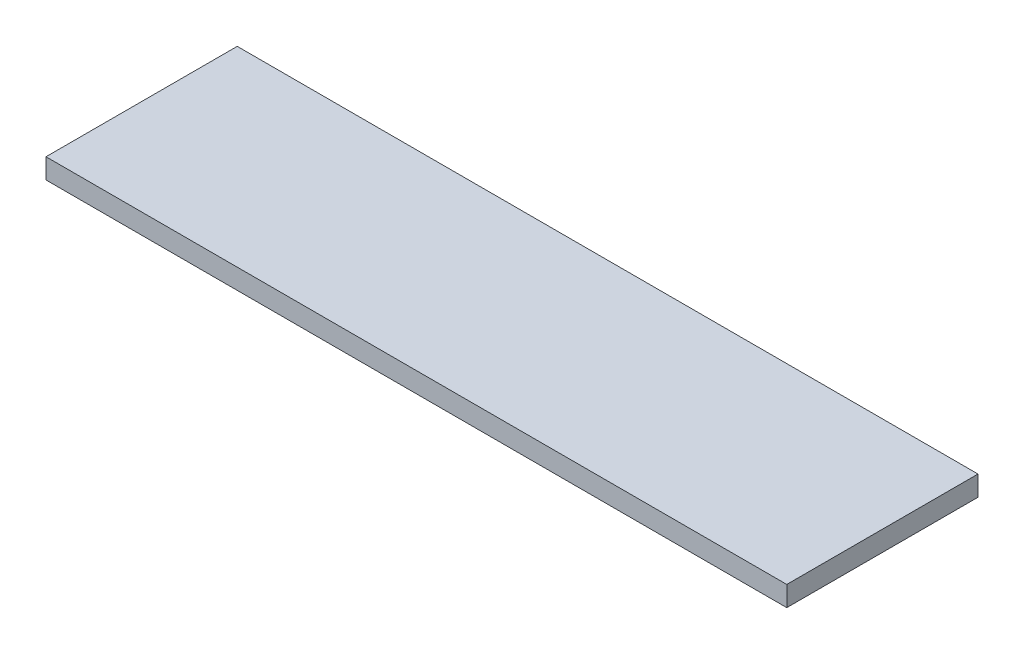
ISO-10303-21;
HEADER;
FILE_DESCRIPTION(('STEP AP214'),'2;1');
FILE_NAME('part.step','',(''),(''),'','','');
FILE_SCHEMA(('AUTOMOTIVE_DESIGN { 1 0 10303 214 1 1 1 1 }'));
ENDSEC;
DATA;
#1=APPLICATION_CONTEXT('core data for automotive mechanical design processes');
#2=APPLICATION_PROTOCOL_DEFINITION('international standard','automotive_design',2000,#1);
#3=PRODUCT_CONTEXT('',#1,'mechanical');
#4=PRODUCT('Part','Part','',(#3));
#5=PRODUCT_RELATED_PRODUCT_CATEGORY('part','',(#4));
#6=PRODUCT_DEFINITION_FORMATION('','',#4);
#7=PRODUCT_DEFINITION_CONTEXT('part definition',#1,'design');
#8=PRODUCT_DEFINITION('design','',#6,#7);
#9=PRODUCT_DEFINITION_SHAPE('','',#8);
#10=(LENGTH_UNIT() NAMED_UNIT(*) SI_UNIT(.MILLI.,.METRE.));
#11=(NAMED_UNIT(*) PLANE_ANGLE_UNIT() SI_UNIT($,.RADIAN.));
#12=(NAMED_UNIT(*) SI_UNIT($,.STERADIAN.) SOLID_ANGLE_UNIT());
#13=UNCERTAINTY_MEASURE_WITH_UNIT(LENGTH_MEASURE(1.E-05),#10,'distance_accuracy_value','');
#14=(GEOMETRIC_REPRESENTATION_CONTEXT(3) GLOBAL_UNCERTAINTY_ASSIGNED_CONTEXT((#13)) GLOBAL_UNIT_ASSIGNED_CONTEXT((#10,
#11,#12)) REPRESENTATION_CONTEXT('',''));
#15=CARTESIAN_POINT('',(0.,0.,0.));
#16=DIRECTION('',(0.,0.,1.));
#17=DIRECTION('',(1.,0.,0.));
#18=AXIS2_PLACEMENT_3D('',#15,#16,#17);
#19=CARTESIAN_POINT('',(184.,10.,47.5));
#20=DIRECTION('',(-1.,0.,0.));
#21=DIRECTION('',(0.,0.,1.));
#22=AXIS2_PLACEMENT_3D('',#19,#20,#21);
#23=PLANE('',#22);
#24=DIRECTION('',(0.,0.,-1.));
#25=VECTOR('',#24,1.);
#26=CARTESIAN_POINT('',(184.,0.,47.5));
#27=LINE('',#26,#25);
#28=CARTESIAN_POINT('',(184.,0.,47.5));
#29=VERTEX_POINT('',#28);
#30=CARTESIAN_POINT('',(184.,0.,-47.5));
#31=VERTEX_POINT('',#30);
#32=EDGE_CURVE('E96',#29,#31,#27,.T.);
#33=ORIENTED_EDGE('',*,*,#32,.T.);
#34=DIRECTION('',(0.,-1.,0.));
#35=VECTOR('',#34,1.);
#36=CARTESIAN_POINT('',(184.,10.,-47.5));
#37=LINE('',#36,#35);
#38=CARTESIAN_POINT('',(184.,10.,-47.5));
#39=VERTEX_POINT('',#38);
#40=EDGE_CURVE('E11',#39,#31,#37,.T.);
#41=ORIENTED_EDGE('',*,*,#40,.F.);
#42=DIRECTION('',(0.,0.,-1.));
#43=VECTOR('',#42,1.);
#44=CARTESIAN_POINT('',(184.,10.,47.5));
#45=LINE('',#44,#43);
#46=CARTESIAN_POINT('',(184.,10.,47.5));
#47=VERTEX_POINT('',#46);
#48=EDGE_CURVE('E84',#47,#39,#45,.T.);
#49=ORIENTED_EDGE('',*,*,#48,.F.);
#50=DIRECTION('',(0.,-1.,0.));
#51=VECTOR('',#50,1.);
#52=CARTESIAN_POINT('',(184.,10.,47.5));
#53=LINE('',#52,#51);
#54=EDGE_CURVE('E92',#47,#29,#53,.T.);
#55=ORIENTED_EDGE('',*,*,#54,.T.);
#56=EDGE_LOOP('',(#33,#41,#49,#55));
#57=FACE_BOUND('',#56,.T.);
#58=ADVANCED_FACE('F33',(#57),#23,.F.);
#59=CARTESIAN_POINT('',(-184.,10.,-47.5));
#60=DIRECTION('',(0.,0.,1.));
#61=DIRECTION('',(1.,0.,0.));
#62=AXIS2_PLACEMENT_3D('',#59,#60,#61);
#63=PLANE('',#62);
#64=DIRECTION('',(-1.,0.,0.));
#65=VECTOR('',#64,1.);
#66=CARTESIAN_POINT('',(-184.,0.,-47.5));
#67=LINE('',#66,#65);
#68=CARTESIAN_POINT('',(-184.,0.,-47.5));
#69=VERTEX_POINT('',#68);
#70=EDGE_CURVE('E88',#31,#69,#67,.T.);
#71=ORIENTED_EDGE('',*,*,#70,.T.);
#72=DIRECTION('',(0.,-1.,0.));
#73=VECTOR('',#72,1.);
#74=CARTESIAN_POINT('',(-184.,10.,-47.5));
#75=LINE('',#74,#73);
#76=CARTESIAN_POINT('',(-184.,10.,-47.5));
#77=VERTEX_POINT('',#76);
#78=EDGE_CURVE('E41',#77,#69,#75,.T.);
#79=ORIENTED_EDGE('',*,*,#78,.F.);
#80=DIRECTION('',(-1.,0.,0.));
#81=VECTOR('',#80,1.);
#82=CARTESIAN_POINT('',(-184.,10.,-47.5));
#83=LINE('',#82,#81);
#84=EDGE_CURVE('E79',#39,#77,#83,.T.);
#85=ORIENTED_EDGE('',*,*,#84,.F.);
#86=ORIENTED_EDGE('',*,*,#40,.T.);
#87=EDGE_LOOP('',(#71,#79,#85,#86));
#88=FACE_BOUND('',#87,.T.);
#89=ADVANCED_FACE('F87',(#88),#63,.F.);
#90=CARTESIAN_POINT('',(-184.,10.,47.5));
#91=DIRECTION('',(1.,0.,0.));
#92=DIRECTION('',(0.,0.,-1.));
#93=AXIS2_PLACEMENT_3D('',#90,#91,#92);
#94=PLANE('',#93);
#95=DIRECTION('',(0.,0.,1.));
#96=VECTOR('',#95,1.);
#97=CARTESIAN_POINT('',(-184.,0.,47.5));
#98=LINE('',#97,#96);
#99=CARTESIAN_POINT('',(-184.,0.,47.5));
#100=VERTEX_POINT('',#99);
#101=EDGE_CURVE('E66',#69,#100,#98,.T.);
#102=ORIENTED_EDGE('',*,*,#101,.T.);
#103=DIRECTION('',(0.,-1.,0.));
#104=VECTOR('',#103,1.);
#105=CARTESIAN_POINT('',(-184.,10.,47.5));
#106=LINE('',#105,#104);
#107=CARTESIAN_POINT('',(-184.,10.,47.5));
#108=VERTEX_POINT('',#107);
#109=EDGE_CURVE('E89',#108,#100,#106,.T.);
#110=ORIENTED_EDGE('',*,*,#109,.F.);
#111=DIRECTION('',(0.,0.,1.));
#112=VECTOR('',#111,1.);
#113=CARTESIAN_POINT('',(-184.,10.,47.5));
#114=LINE('',#113,#112);
#115=EDGE_CURVE('E82',#77,#108,#114,.T.);
#116=ORIENTED_EDGE('',*,*,#115,.F.);
#117=ORIENTED_EDGE('',*,*,#78,.T.);
#118=EDGE_LOOP('',(#102,#110,#116,#117));
#119=FACE_BOUND('',#118,.T.);
#120=ADVANCED_FACE('F90',(#119),#94,.F.);
#121=CARTESIAN_POINT('',(-184.,10.,47.5));
#122=DIRECTION('',(0.,0.,-1.));
#123=DIRECTION('',(-1.,0.,0.));
#124=AXIS2_PLACEMENT_3D('',#121,#122,#123);
#125=PLANE('',#124);
#126=DIRECTION('',(1.,0.,0.));
#127=VECTOR('',#126,1.);
#128=CARTESIAN_POINT('',(-184.,0.,47.5));
#129=LINE('',#128,#127);
#130=EDGE_CURVE('E72',#100,#29,#129,.T.);
#131=ORIENTED_EDGE('',*,*,#130,.T.);
#132=ORIENTED_EDGE('',*,*,#54,.F.);
#133=DIRECTION('',(1.,0.,0.));
#134=VECTOR('',#133,1.);
#135=CARTESIAN_POINT('',(-184.,10.,47.5));
#136=LINE('',#135,#134);
#137=EDGE_CURVE('E49',#108,#47,#136,.T.);
#138=ORIENTED_EDGE('',*,*,#137,.F.);
#139=ORIENTED_EDGE('',*,*,#109,.T.);
#140=EDGE_LOOP('',(#131,#132,#138,#139));
#141=FACE_BOUND('',#140,.T.);
#142=ADVANCED_FACE('F103',(#141),#125,.F.);
#143=CARTESIAN_POINT('',(0.,10.,0.));
#144=DIRECTION('',(0.,-1.,0.));
#145=DIRECTION('',(0.,0.,-1.));
#146=AXIS2_PLACEMENT_3D('',#143,#144,#145);
#147=PLANE('',#146);
#148=ORIENTED_EDGE('',*,*,#48,.T.);
#149=ORIENTED_EDGE('',*,*,#84,.T.);
#150=ORIENTED_EDGE('',*,*,#115,.T.);
#151=ORIENTED_EDGE('',*,*,#137,.T.);
#152=EDGE_LOOP('',(#148,#149,#150,#151));
#153=FACE_BOUND('',#152,.T.);
#154=ADVANCED_FACE('F80',(#153),#147,.F.);
#155=CARTESIAN_POINT('',(0.,0.,0.));
#156=DIRECTION('',(0.,-1.,0.));
#157=DIRECTION('',(0.,0.,-1.));
#158=AXIS2_PLACEMENT_3D('',#155,#156,#157);
#159=PLANE('',#158);
#160=ORIENTED_EDGE('',*,*,#32,.F.);
#161=ORIENTED_EDGE('',*,*,#130,.F.);
#162=ORIENTED_EDGE('',*,*,#101,.F.);
#163=ORIENTED_EDGE('',*,*,#70,.F.);
#164=EDGE_LOOP('',(#160,#161,#162,#163));
#165=FACE_BOUND('',#164,.T.);
#166=ADVANCED_FACE('F106',(#165),#159,.T.);
#167=CLOSED_SHELL('',(#58,#89,#120,#142,#154,#166));
#168=MANIFOLD_SOLID_BREP('B2',#167);
#169=ADVANCED_BREP_SHAPE_REPRESENTATION('',(#18,#168),#14);
#170=SHAPE_DEFINITION_REPRESENTATION(#9,#169);
ENDSEC;
END-ISO-10303-21;
